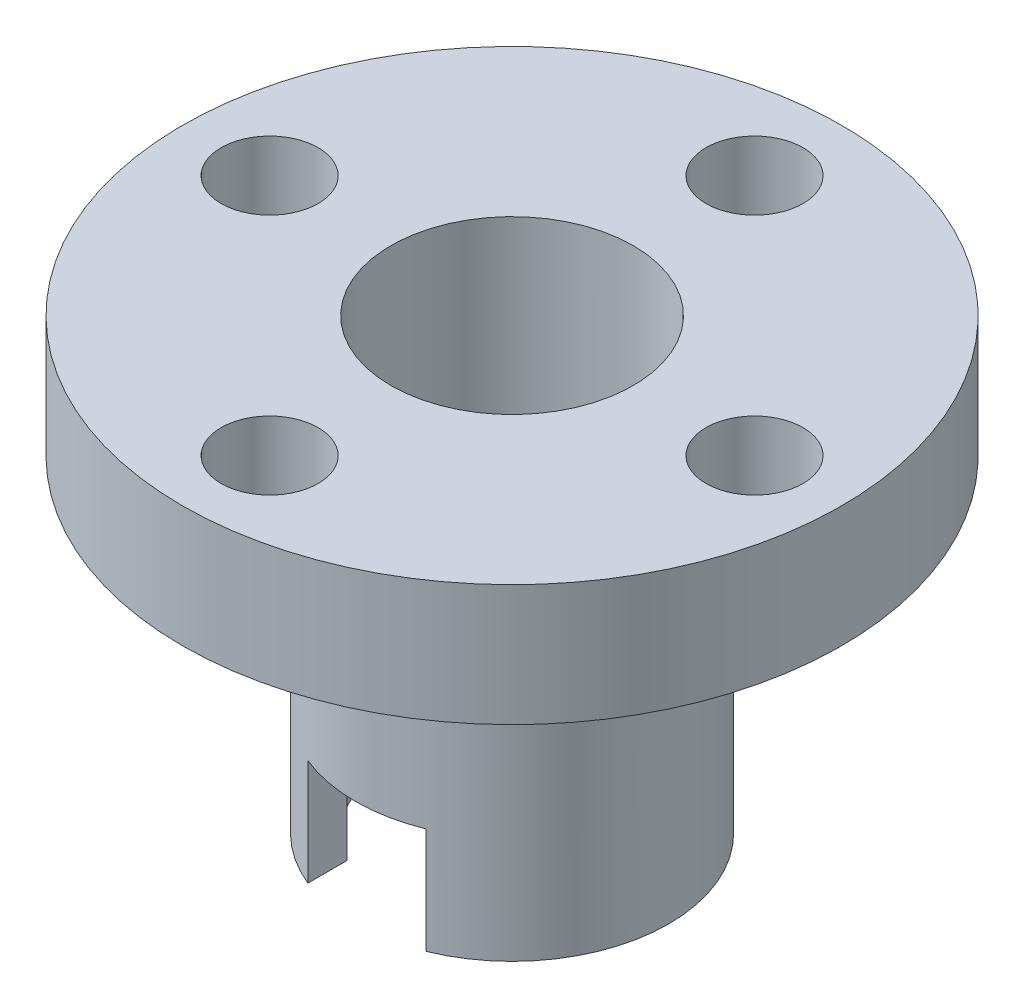
ISO-10303-21;
HEADER;
FILE_DESCRIPTION(('STEP AP214'),'2;1');
FILE_NAME('part.step','',(''),(''),'','','');
FILE_SCHEMA(('AUTOMOTIVE_DESIGN { 1 0 10303 214 1 1 1 1 }'));
ENDSEC;
DATA;
#1=APPLICATION_CONTEXT('core data for automotive mechanical design processes');
#2=APPLICATION_PROTOCOL_DEFINITION('international standard','automotive_design',2000,#1);
#3=PRODUCT_CONTEXT('',#1,'mechanical');
#4=PRODUCT('Part','Part','',(#3));
#5=PRODUCT_RELATED_PRODUCT_CATEGORY('part','',(#4));
#6=PRODUCT_DEFINITION_FORMATION('','',#4);
#7=PRODUCT_DEFINITION_CONTEXT('part definition',#1,'design');
#8=PRODUCT_DEFINITION('design','',#6,#7);
#9=PRODUCT_DEFINITION_SHAPE('','',#8);
#10=(LENGTH_UNIT() NAMED_UNIT(*) SI_UNIT(.MILLI.,.METRE.));
#11=(NAMED_UNIT(*) PLANE_ANGLE_UNIT() SI_UNIT($,.RADIAN.));
#12=(NAMED_UNIT(*) SI_UNIT($,.STERADIAN.) SOLID_ANGLE_UNIT());
#13=UNCERTAINTY_MEASURE_WITH_UNIT(LENGTH_MEASURE(1.E-05),#10,'distance_accuracy_value','');
#14=(GEOMETRIC_REPRESENTATION_CONTEXT(3) GLOBAL_UNCERTAINTY_ASSIGNED_CONTEXT((#13)) GLOBAL_UNIT_ASSIGNED_CONTEXT((#10,
#11,#12)) REPRESENTATION_CONTEXT('',''));
#15=CARTESIAN_POINT('',(0.,0.,0.));
#16=DIRECTION('',(0.,0.,1.));
#17=DIRECTION('',(1.,0.,0.));
#18=AXIS2_PLACEMENT_3D('',#15,#16,#17);
#19=CARTESIAN_POINT('',(0.,0.,0.));
#20=DIRECTION('',(0.,1.,0.));
#21=DIRECTION('',(0.,0.,1.));
#22=AXIS2_PLACEMENT_3D('',#19,#20,#21);
#23=PLANE('',#22);
#24=CARTESIAN_POINT('',(0.,0.,-8.));
#25=DIRECTION('',(0.,1.,0.));
#26=DIRECTION('',(0.,0.,1.));
#27=AXIS2_PLACEMENT_3D('',#24,#25,#26);
#28=CIRCLE('',#27,1.6);
#29=CARTESIAN_POINT('',(0.,0.,-6.4));
#30=VERTEX_POINT('',#29);
#31=EDGE_CURVE('E188',#30,#30,#28,.T.);
#32=ORIENTED_EDGE('',*,*,#31,.T.);
#33=EDGE_LOOP('',(#32));
#34=FACE_BOUND('',#33,.T.);
#35=CARTESIAN_POINT('',(0.,0.,8.));
#36=DIRECTION('',(0.,1.,0.));
#37=DIRECTION('',(0.,0.,1.));
#38=AXIS2_PLACEMENT_3D('',#35,#36,#37);
#39=CIRCLE('',#38,1.6);
#40=CARTESIAN_POINT('',(0.,0.,9.6));
#41=VERTEX_POINT('',#40);
#42=EDGE_CURVE('E192',#41,#41,#39,.T.);
#43=ORIENTED_EDGE('',*,*,#42,.T.);
#44=EDGE_LOOP('',(#43));
#45=FACE_BOUND('',#44,.T.);
#46=CARTESIAN_POINT('',(-8.,0.,0.));
#47=DIRECTION('',(0.,1.,0.));
#48=DIRECTION('',(0.,0.,1.));
#49=AXIS2_PLACEMENT_3D('',#46,#47,#48);
#50=CIRCLE('',#49,1.6);
#51=CARTESIAN_POINT('',(-8.,0.,1.6));
#52=VERTEX_POINT('',#51);
#53=EDGE_CURVE('E196',#52,#52,#50,.T.);
#54=ORIENTED_EDGE('',*,*,#53,.T.);
#55=EDGE_LOOP('',(#54));
#56=FACE_BOUND('',#55,.T.);
#57=CARTESIAN_POINT('',(8.,0.,0.));
#58=DIRECTION('',(0.,1.,0.));
#59=DIRECTION('',(0.,0.,1.));
#60=AXIS2_PLACEMENT_3D('',#57,#58,#59);
#61=CIRCLE('',#60,1.6);
#62=CARTESIAN_POINT('',(8.,0.,1.6));
#63=VERTEX_POINT('',#62);
#64=EDGE_CURVE('E199',#63,#63,#61,.T.);
#65=ORIENTED_EDGE('',*,*,#64,.T.);
#66=EDGE_LOOP('',(#65));
#67=FACE_BOUND('',#66,.T.);
#68=CARTESIAN_POINT('',(0.,0.,0.));
#69=DIRECTION('',(0.,-1.,0.));
#70=DIRECTION('',(0.,0.,-1.));
#71=AXIS2_PLACEMENT_3D('',#68,#69,#70);
#72=CIRCLE('',#71,5.17);
#73=CARTESIAN_POINT('',(0.,0.,-5.17));
#74=VERTEX_POINT('',#73);
#75=EDGE_CURVE('E184',#74,#74,#72,.T.);
#76=ORIENTED_EDGE('',*,*,#75,.F.);
#77=EDGE_LOOP('',(#76));
#78=FACE_BOUND('',#77,.T.);
#79=CARTESIAN_POINT('',(0.,0.,0.));
#80=DIRECTION('',(0.,1.,0.));
#81=DIRECTION('',(0.,0.,1.));
#82=AXIS2_PLACEMENT_3D('',#79,#80,#81);
#83=CIRCLE('',#82,10.875);
#84=CARTESIAN_POINT('',(0.,0.,10.875));
#85=VERTEX_POINT('',#84);
#86=EDGE_CURVE('E19',#85,#85,#83,.T.);
#87=ORIENTED_EDGE('',*,*,#86,.F.);
#88=EDGE_LOOP('',(#87));
#89=FACE_BOUND('',#88,.T.);
#90=ADVANCED_FACE('F16',(#34,#45,#56,#67,#78,#89),#23,.F.);
#91=CARTESIAN_POINT('',(0.,0.,0.));
#92=DIRECTION('',(0.,1.,0.));
#93=DIRECTION('',(0.,0.,1.));
#94=AXIS2_PLACEMENT_3D('',#91,#92,#93);
#95=CYLINDRICAL_SURFACE('',#94,10.875);
#96=ORIENTED_EDGE('',*,*,#86,.T.);
#97=EDGE_LOOP('',(#96));
#98=FACE_BOUND('',#97,.T.);
#99=CARTESIAN_POINT('',(0.,4.,0.));
#100=DIRECTION('',(0.,1.,0.));
#101=DIRECTION('',(0.,0.,1.));
#102=AXIS2_PLACEMENT_3D('',#99,#100,#101);
#103=CIRCLE('',#102,10.875);
#104=CARTESIAN_POINT('',(0.,4.,10.875));
#105=VERTEX_POINT('',#104);
#106=EDGE_CURVE('E180',#105,#105,#103,.T.);
#107=ORIENTED_EDGE('',*,*,#106,.F.);
#108=EDGE_LOOP('',(#107));
#109=FACE_BOUND('',#108,.T.);
#110=ADVANCED_FACE('F208',(#98,#109),#95,.T.);
#111=CARTESIAN_POINT('',(8.,-27.0181398539629,0.));
#112=DIRECTION('',(0.,1.,0.));
#113=DIRECTION('',(0.,0.,1.));
#114=AXIS2_PLACEMENT_3D('',#111,#112,#113);
#115=CYLINDRICAL_SURFACE('',#114,1.6);
#116=CARTESIAN_POINT('',(8.,4.,0.));
#117=DIRECTION('',(0.,1.,0.));
#118=DIRECTION('',(0.,0.,1.));
#119=AXIS2_PLACEMENT_3D('',#116,#117,#118);
#120=CIRCLE('',#119,1.6);
#121=CARTESIAN_POINT('',(8.,4.,1.6));
#122=VERTEX_POINT('',#121);
#123=EDGE_CURVE('E176',#122,#122,#120,.F.);
#124=ORIENTED_EDGE('',*,*,#123,.F.);
#125=EDGE_LOOP('',(#124));
#126=FACE_BOUND('',#125,.T.);
#127=ORIENTED_EDGE('',*,*,#64,.F.);
#128=EDGE_LOOP('',(#127));
#129=FACE_BOUND('',#128,.T.);
#130=ADVANCED_FACE('F216',(#126,#129),#115,.F.);
#131=CARTESIAN_POINT('',(-8.,-27.0181398539629,0.));
#132=DIRECTION('',(0.,1.,0.));
#133=DIRECTION('',(0.,0.,1.));
#134=AXIS2_PLACEMENT_3D('',#131,#132,#133);
#135=CYLINDRICAL_SURFACE('',#134,1.6);
#136=CARTESIAN_POINT('',(-8.,4.,0.));
#137=DIRECTION('',(0.,1.,0.));
#138=DIRECTION('',(0.,0.,1.));
#139=AXIS2_PLACEMENT_3D('',#136,#137,#138);
#140=CIRCLE('',#139,1.6);
#141=CARTESIAN_POINT('',(-8.,4.,1.6));
#142=VERTEX_POINT('',#141);
#143=EDGE_CURVE('E172',#142,#142,#140,.F.);
#144=ORIENTED_EDGE('',*,*,#143,.F.);
#145=EDGE_LOOP('',(#144));
#146=FACE_BOUND('',#145,.T.);
#147=ORIENTED_EDGE('',*,*,#53,.F.);
#148=EDGE_LOOP('',(#147));
#149=FACE_BOUND('',#148,.T.);
#150=ADVANCED_FACE('F270',(#146,#149),#135,.F.);
#151=CARTESIAN_POINT('',(0.,-27.0181398539629,8.));
#152=DIRECTION('',(0.,1.,0.));
#153=DIRECTION('',(0.,0.,1.));
#154=AXIS2_PLACEMENT_3D('',#151,#152,#153);
#155=CYLINDRICAL_SURFACE('',#154,1.6);
#156=CARTESIAN_POINT('',(0.,4.,8.));
#157=DIRECTION('',(0.,1.,0.));
#158=DIRECTION('',(0.,0.,1.));
#159=AXIS2_PLACEMENT_3D('',#156,#157,#158);
#160=CIRCLE('',#159,1.6);
#161=CARTESIAN_POINT('',(0.,4.,9.6));
#162=VERTEX_POINT('',#161);
#163=EDGE_CURVE('E168',#162,#162,#160,.F.);
#164=ORIENTED_EDGE('',*,*,#163,.F.);
#165=EDGE_LOOP('',(#164));
#166=FACE_BOUND('',#165,.T.);
#167=ORIENTED_EDGE('',*,*,#42,.F.);
#168=EDGE_LOOP('',(#167));
#169=FACE_BOUND('',#168,.T.);
#170=ADVANCED_FACE('F266',(#166,#169),#155,.F.);
#171=CARTESIAN_POINT('',(0.,-27.0181398539629,-8.));
#172=DIRECTION('',(0.,1.,0.));
#173=DIRECTION('',(0.,0.,1.));
#174=AXIS2_PLACEMENT_3D('',#171,#172,#173);
#175=CYLINDRICAL_SURFACE('',#174,1.6);
#176=CARTESIAN_POINT('',(0.,4.,-8.));
#177=DIRECTION('',(0.,1.,0.));
#178=DIRECTION('',(0.,0.,1.));
#179=AXIS2_PLACEMENT_3D('',#176,#177,#178);
#180=CIRCLE('',#179,1.6);
#181=CARTESIAN_POINT('',(0.,4.,-6.4));
#182=VERTEX_POINT('',#181);
#183=EDGE_CURVE('E106',#182,#182,#180,.F.);
#184=ORIENTED_EDGE('',*,*,#183,.F.);
#185=EDGE_LOOP('',(#184));
#186=FACE_BOUND('',#185,.T.);
#187=ORIENTED_EDGE('',*,*,#31,.F.);
#188=EDGE_LOOP('',(#187));
#189=FACE_BOUND('',#188,.T.);
#190=ADVANCED_FACE('F262',(#186,#189),#175,.F.);
#191=CARTESIAN_POINT('',(0.,0.,0.));
#192=DIRECTION('',(0.,-1.,0.));
#193=DIRECTION('',(0.,0.,-1.));
#194=AXIS2_PLACEMENT_3D('',#191,#192,#193);
#195=CYLINDRICAL_SURFACE('',#194,5.17);
#196=ORIENTED_EDGE('',*,*,#75,.T.);
#197=EDGE_LOOP('',(#196));
#198=FACE_BOUND('',#197,.T.);
#199=DIRECTION('',(0.,1.,0.));
#200=VECTOR('',#199,1.);
#201=CARTESIAN_POINT('',(1.95,-9.05,-4.78815204436952));
#202=LINE('',#201,#200);
#203=CARTESIAN_POINT('',(1.95,-10.8,-4.78815204436952));
#204=VERTEX_POINT('',#203);
#205=CARTESIAN_POINT('',(1.95,-7.3,-4.78815204436952));
#206=VERTEX_POINT('',#205);
#207=EDGE_CURVE('E124',#204,#206,#202,.T.);
#208=ORIENTED_EDGE('',*,*,#207,.T.);
#209=CARTESIAN_POINT('',(0.,-7.3,0.));
#210=DIRECTION('',(0.,-1.,0.));
#211=DIRECTION('',(0.,0.,-1.));
#212=AXIS2_PLACEMENT_3D('',#209,#210,#211);
#213=CIRCLE('',#212,5.17);
#214=CARTESIAN_POINT('',(-1.95,-7.3,-4.78815204436952));
#215=VERTEX_POINT('',#214);
#216=EDGE_CURVE('E115',#206,#215,#213,.F.);
#217=ORIENTED_EDGE('',*,*,#216,.T.);
#218=DIRECTION('',(0.,1.,0.));
#219=VECTOR('',#218,1.);
#220=CARTESIAN_POINT('',(-1.95,-9.05,-4.78815204436952));
#221=LINE('',#220,#219);
#222=CARTESIAN_POINT('',(-1.95,-10.8,-4.78815204436952));
#223=VERTEX_POINT('',#222);
#224=EDGE_CURVE('E109',#215,#223,#221,.F.);
#225=ORIENTED_EDGE('',*,*,#224,.T.);
#226=CARTESIAN_POINT('',(0.,-10.8,0.));
#227=DIRECTION('',(0.,-1.,0.));
#228=DIRECTION('',(0.,0.,-1.));
#229=AXIS2_PLACEMENT_3D('',#226,#227,#228);
#230=CIRCLE('',#229,5.17);
#231=CARTESIAN_POINT('',(-1.95,-10.8,4.78815204436952));
#232=VERTEX_POINT('',#231);
#233=EDGE_CURVE('E96',#223,#232,#230,.F.);
#234=ORIENTED_EDGE('',*,*,#233,.T.);
#235=DIRECTION('',(0.,1.,0.));
#236=VECTOR('',#235,1.);
#237=CARTESIAN_POINT('',(-1.95,-9.05,4.78815204436952));
#238=LINE('',#237,#236);
#239=CARTESIAN_POINT('',(-1.95,-7.3,4.78815204436952));
#240=VERTEX_POINT('',#239);
#241=EDGE_CURVE('E134',#232,#240,#238,.T.);
#242=ORIENTED_EDGE('',*,*,#241,.T.);
#243=CARTESIAN_POINT('',(0.,-7.3,0.));
#244=DIRECTION('',(0.,-1.,0.));
#245=DIRECTION('',(0.,0.,-1.));
#246=AXIS2_PLACEMENT_3D('',#243,#244,#245);
#247=CIRCLE('',#246,5.17);
#248=CARTESIAN_POINT('',(1.95,-7.3,4.78815204436952));
#249=VERTEX_POINT('',#248);
#250=EDGE_CURVE('E162',#240,#249,#247,.F.);
#251=ORIENTED_EDGE('',*,*,#250,.T.);
#252=DIRECTION('',(0.,1.,0.));
#253=VECTOR('',#252,1.);
#254=CARTESIAN_POINT('',(1.95,-9.05,4.78815204436952));
#255=LINE('',#254,#253);
#256=CARTESIAN_POINT('',(1.95,-10.8,4.78815204436952));
#257=VERTEX_POINT('',#256);
#258=EDGE_CURVE('E129',#249,#257,#255,.F.);
#259=ORIENTED_EDGE('',*,*,#258,.T.);
#260=CARTESIAN_POINT('',(0.,-10.8,0.));
#261=DIRECTION('',(0.,-1.,0.));
#262=DIRECTION('',(0.,0.,-1.));
#263=AXIS2_PLACEMENT_3D('',#260,#261,#262);
#264=CIRCLE('',#263,5.17);
#265=EDGE_CURVE('E159',#257,#204,#264,.F.);
#266=ORIENTED_EDGE('',*,*,#265,.T.);
#267=EDGE_LOOP('',(#208,#217,#225,#234,#242,#251,#259,#266));
#268=FACE_BOUND('',#267,.T.);
#269=ADVANCED_FACE('F113',(#198,#268),#195,.T.);
#270=CARTESIAN_POINT('',(0.,4.,0.));
#271=DIRECTION('',(0.,1.,0.));
#272=DIRECTION('',(0.,0.,1.));
#273=AXIS2_PLACEMENT_3D('',#270,#271,#272);
#274=PLANE('',#273);
#275=CARTESIAN_POINT('',(0.,4.,0.));
#276=DIRECTION('',(0.,1.,0.));
#277=DIRECTION('',(0.,0.,1.));
#278=AXIS2_PLACEMENT_3D('',#275,#276,#277);
#279=CIRCLE('',#278,4.);
#280=CARTESIAN_POINT('',(0.,4.,4.));
#281=VERTEX_POINT('',#280);
#282=EDGE_CURVE('E111',#281,#281,#279,.F.);
#283=ORIENTED_EDGE('',*,*,#282,.T.);
#284=EDGE_LOOP('',(#283));
#285=FACE_BOUND('',#284,.T.);
#286=ORIENTED_EDGE('',*,*,#183,.T.);
#287=EDGE_LOOP('',(#286));
#288=FACE_BOUND('',#287,.T.);
#289=ORIENTED_EDGE('',*,*,#163,.T.);
#290=EDGE_LOOP('',(#289));
#291=FACE_BOUND('',#290,.T.);
#292=ORIENTED_EDGE('',*,*,#143,.T.);
#293=EDGE_LOOP('',(#292));
#294=FACE_BOUND('',#293,.T.);
#295=ORIENTED_EDGE('',*,*,#123,.T.);
#296=EDGE_LOOP('',(#295));
#297=FACE_BOUND('',#296,.T.);
#298=ORIENTED_EDGE('',*,*,#106,.T.);
#299=EDGE_LOOP('',(#298));
#300=FACE_BOUND('',#299,.T.);
#301=ADVANCED_FACE('F256',(#285,#288,#291,#294,#297,#300),#274,.T.);
#302=CARTESIAN_POINT('',(0.,-10.8,0.));
#303=DIRECTION('',(0.,1.,0.));
#304=DIRECTION('',(0.,0.,1.));
#305=AXIS2_PLACEMENT_3D('',#302,#303,#304);
#306=PLANE('',#305);
#307=CARTESIAN_POINT('',(0.,-10.8,0.));
#308=DIRECTION('',(0.,1.,0.));
#309=DIRECTION('',(0.,0.,1.));
#310=AXIS2_PLACEMENT_3D('',#307,#308,#309);
#311=CIRCLE('',#310,4.);
#312=CARTESIAN_POINT('',(-1.95,-10.8,-3.49249194702006));
#313=VERTEX_POINT('',#312);
#314=CARTESIAN_POINT('',(-1.95,-10.8,3.49249194702006));
#315=VERTEX_POINT('',#314);
#316=EDGE_CURVE('E152',#313,#315,#311,.T.);
#317=ORIENTED_EDGE('',*,*,#316,.T.);
#318=DIRECTION('',(0.,0.,1.));
#319=VECTOR('',#318,1.);
#320=CARTESIAN_POINT('',(-1.95,-10.8,0.));
#321=LINE('',#320,#319);
#322=EDGE_CURVE('E101',#315,#232,#321,.T.);
#323=ORIENTED_EDGE('',*,*,#322,.T.);
#324=ORIENTED_EDGE('',*,*,#233,.F.);
#325=DIRECTION('',(0.,0.,1.));
#326=VECTOR('',#325,1.);
#327=CARTESIAN_POINT('',(-1.95,-10.8,0.));
#328=LINE('',#327,#326);
#329=EDGE_CURVE('E100',#223,#313,#328,.T.);
#330=ORIENTED_EDGE('',*,*,#329,.T.);
#331=EDGE_LOOP('',(#317,#323,#324,#330));
#332=FACE_BOUND('',#331,.T.);
#333=ADVANCED_FACE('F99',(#332),#306,.F.);
#334=CARTESIAN_POINT('',(-1.95,-9.05,0.));
#335=DIRECTION('',(-1.,0.,0.));
#336=DIRECTION('',(0.,0.,1.));
#337=AXIS2_PLACEMENT_3D('',#334,#335,#336);
#338=PLANE('',#337);
#339=DIRECTION('',(0.,0.,1.));
#340=VECTOR('',#339,1.);
#341=CARTESIAN_POINT('',(-1.95,-7.3,-5.17));
#342=LINE('',#341,#340);
#343=CARTESIAN_POINT('',(-1.95,-7.3,3.49249194702006));
#344=VERTEX_POINT('',#343);
#345=EDGE_CURVE('E137',#344,#240,#342,.T.);
#346=ORIENTED_EDGE('',*,*,#345,.T.);
#347=ORIENTED_EDGE('',*,*,#241,.F.);
#348=ORIENTED_EDGE('',*,*,#322,.F.);
#349=DIRECTION('',(0.,1.,0.));
#350=VECTOR('',#349,1.);
#351=CARTESIAN_POINT('',(-1.95,0.,3.49249194702006));
#352=LINE('',#351,#350);
#353=EDGE_CURVE('E151',#315,#344,#352,.T.);
#354=ORIENTED_EDGE('',*,*,#353,.T.);
#355=EDGE_LOOP('',(#346,#347,#348,#354));
#356=FACE_BOUND('',#355,.T.);
#357=ADVANCED_FACE('F249',(#356),#338,.F.);
#358=CARTESIAN_POINT('',(0.,-7.3,-5.17));
#359=DIRECTION('',(0.,1.,0.));
#360=DIRECTION('',(0.,0.,1.));
#361=AXIS2_PLACEMENT_3D('',#358,#359,#360);
#362=PLANE('',#361);
#363=DIRECTION('',(0.,0.,-1.));
#364=VECTOR('',#363,1.);
#365=CARTESIAN_POINT('',(1.95,-7.3,0.));
#366=LINE('',#365,#364);
#367=CARTESIAN_POINT('',(1.95,-7.3,3.49249194702006));
#368=VERTEX_POINT('',#367);
#369=EDGE_CURVE('E133',#368,#249,#366,.F.);
#370=ORIENTED_EDGE('',*,*,#369,.T.);
#371=ORIENTED_EDGE('',*,*,#250,.F.);
#372=ORIENTED_EDGE('',*,*,#345,.F.);
#373=CARTESIAN_POINT('',(0.,-7.3,0.));
#374=DIRECTION('',(0.,1.,0.));
#375=DIRECTION('',(0.,0.,1.));
#376=AXIS2_PLACEMENT_3D('',#373,#374,#375);
#377=CIRCLE('',#376,4.);
#378=EDGE_CURVE('E147',#344,#368,#377,.T.);
#379=ORIENTED_EDGE('',*,*,#378,.T.);
#380=EDGE_LOOP('',(#370,#371,#372,#379));
#381=FACE_BOUND('',#380,.T.);
#382=ADVANCED_FACE('F245',(#381),#362,.F.);
#383=CARTESIAN_POINT('',(1.95,-9.05,0.));
#384=DIRECTION('',(1.,0.,0.));
#385=DIRECTION('',(0.,0.,-1.));
#386=AXIS2_PLACEMENT_3D('',#383,#384,#385);
#387=PLANE('',#386);
#388=DIRECTION('',(0.,0.,1.));
#389=VECTOR('',#388,1.);
#390=CARTESIAN_POINT('',(1.95,-10.8,0.));
#391=LINE('',#390,#389);
#392=CARTESIAN_POINT('',(1.95,-10.8,3.49249194702006));
#393=VERTEX_POINT('',#392);
#394=EDGE_CURVE('E132',#393,#257,#391,.T.);
#395=ORIENTED_EDGE('',*,*,#394,.T.);
#396=ORIENTED_EDGE('',*,*,#258,.F.);
#397=ORIENTED_EDGE('',*,*,#369,.F.);
#398=DIRECTION('',(0.,1.,0.));
#399=VECTOR('',#398,1.);
#400=CARTESIAN_POINT('',(1.95,0.,3.49249194702006));
#401=LINE('',#400,#399);
#402=EDGE_CURVE('E146',#368,#393,#401,.F.);
#403=ORIENTED_EDGE('',*,*,#402,.T.);
#404=EDGE_LOOP('',(#395,#396,#397,#403));
#405=FACE_BOUND('',#404,.T.);
#406=ADVANCED_FACE('F241',(#405),#387,.F.);
#407=CARTESIAN_POINT('',(0.,-10.8,0.));
#408=DIRECTION('',(0.,1.,0.));
#409=DIRECTION('',(0.,0.,1.));
#410=AXIS2_PLACEMENT_3D('',#407,#408,#409);
#411=PLANE('',#410);
#412=ORIENTED_EDGE('',*,*,#265,.F.);
#413=ORIENTED_EDGE('',*,*,#394,.F.);
#414=CARTESIAN_POINT('',(0.,-10.8,0.));
#415=DIRECTION('',(0.,1.,0.));
#416=DIRECTION('',(0.,0.,1.));
#417=AXIS2_PLACEMENT_3D('',#414,#415,#416);
#418=CIRCLE('',#417,4.);
#419=CARTESIAN_POINT('',(1.95,-10.8,-3.49249194702006));
#420=VERTEX_POINT('',#419);
#421=EDGE_CURVE('E142',#393,#420,#418,.T.);
#422=ORIENTED_EDGE('',*,*,#421,.T.);
#423=DIRECTION('',(0.,0.,-1.));
#424=VECTOR('',#423,1.);
#425=CARTESIAN_POINT('',(1.95,-10.8,0.));
#426=LINE('',#425,#424);
#427=EDGE_CURVE('E128',#420,#204,#426,.T.);
#428=ORIENTED_EDGE('',*,*,#427,.T.);
#429=EDGE_LOOP('',(#412,#413,#422,#428));
#430=FACE_BOUND('',#429,.T.);
#431=ADVANCED_FACE('F237',(#430),#411,.F.);
#432=CARTESIAN_POINT('',(1.95,-9.05,0.));
#433=DIRECTION('',(1.,0.,0.));
#434=DIRECTION('',(0.,0.,-1.));
#435=AXIS2_PLACEMENT_3D('',#432,#433,#434);
#436=PLANE('',#435);
#437=DIRECTION('',(0.,0.,1.));
#438=VECTOR('',#437,1.);
#439=CARTESIAN_POINT('',(1.95,-7.3,-5.17));
#440=LINE('',#439,#438);
#441=CARTESIAN_POINT('',(1.95,-7.3,-3.49249194702006));
#442=VERTEX_POINT('',#441);
#443=EDGE_CURVE('E127',#442,#206,#440,.F.);
#444=ORIENTED_EDGE('',*,*,#443,.T.);
#445=ORIENTED_EDGE('',*,*,#207,.F.);
#446=ORIENTED_EDGE('',*,*,#427,.F.);
#447=DIRECTION('',(0.,1.,0.));
#448=VECTOR('',#447,1.);
#449=CARTESIAN_POINT('',(1.95,0.,-3.49249194702006));
#450=LINE('',#449,#448);
#451=EDGE_CURVE('E141',#420,#442,#450,.T.);
#452=ORIENTED_EDGE('',*,*,#451,.T.);
#453=EDGE_LOOP('',(#444,#445,#446,#452));
#454=FACE_BOUND('',#453,.T.);
#455=ADVANCED_FACE('F233',(#454),#436,.F.);
#456=CARTESIAN_POINT('',(0.,-7.3,-5.17));
#457=DIRECTION('',(0.,1.,0.));
#458=DIRECTION('',(0.,0.,1.));
#459=AXIS2_PLACEMENT_3D('',#456,#457,#458);
#460=PLANE('',#459);
#461=DIRECTION('',(0.,0.,1.));
#462=VECTOR('',#461,1.);
#463=CARTESIAN_POINT('',(-1.95,-7.3,0.));
#464=LINE('',#463,#462);
#465=CARTESIAN_POINT('',(-1.95,-7.3,-3.49249194702006));
#466=VERTEX_POINT('',#465);
#467=EDGE_CURVE('E38',#466,#215,#464,.F.);
#468=ORIENTED_EDGE('',*,*,#467,.T.);
#469=ORIENTED_EDGE('',*,*,#216,.F.);
#470=ORIENTED_EDGE('',*,*,#443,.F.);
#471=CARTESIAN_POINT('',(0.,-7.3,0.));
#472=DIRECTION('',(0.,1.,0.));
#473=DIRECTION('',(0.,0.,1.));
#474=AXIS2_PLACEMENT_3D('',#471,#472,#473);
#475=CIRCLE('',#474,4.);
#476=EDGE_CURVE('E26',#442,#466,#475,.T.);
#477=ORIENTED_EDGE('',*,*,#476,.T.);
#478=EDGE_LOOP('',(#468,#469,#470,#477));
#479=FACE_BOUND('',#478,.T.);
#480=ADVANCED_FACE('F226',(#479),#460,.F.);
#481=CARTESIAN_POINT('',(-1.95,-9.05,0.));
#482=DIRECTION('',(-1.,0.,0.));
#483=DIRECTION('',(0.,0.,1.));
#484=AXIS2_PLACEMENT_3D('',#481,#482,#483);
#485=PLANE('',#484);
#486=ORIENTED_EDGE('',*,*,#329,.F.);
#487=ORIENTED_EDGE('',*,*,#224,.F.);
#488=ORIENTED_EDGE('',*,*,#467,.F.);
#489=DIRECTION('',(0.,1.,0.));
#490=VECTOR('',#489,1.);
#491=CARTESIAN_POINT('',(-1.95,0.,-3.49249194702006));
#492=LINE('',#491,#490);
#493=EDGE_CURVE('E11',#466,#313,#492,.F.);
#494=ORIENTED_EDGE('',*,*,#493,.T.);
#495=EDGE_LOOP('',(#486,#487,#488,#494));
#496=FACE_BOUND('',#495,.T.);
#497=ADVANCED_FACE('F108',(#496),#485,.F.);
#498=CARTESIAN_POINT('',(0.,0.,0.));
#499=DIRECTION('',(0.,1.,0.));
#500=DIRECTION('',(0.,0.,1.));
#501=AXIS2_PLACEMENT_3D('',#498,#499,#500);
#502=CYLINDRICAL_SURFACE('',#501,4.);
#503=ORIENTED_EDGE('',*,*,#476,.F.);
#504=ORIENTED_EDGE('',*,*,#451,.F.);
#505=ORIENTED_EDGE('',*,*,#421,.F.);
#506=ORIENTED_EDGE('',*,*,#402,.F.);
#507=ORIENTED_EDGE('',*,*,#378,.F.);
#508=ORIENTED_EDGE('',*,*,#353,.F.);
#509=ORIENTED_EDGE('',*,*,#316,.F.);
#510=ORIENTED_EDGE('',*,*,#493,.F.);
#511=EDGE_LOOP('',(#503,#504,#505,#506,#507,#508,#509,#510));
#512=FACE_BOUND('',#511,.T.);
#513=ORIENTED_EDGE('',*,*,#282,.F.);
#514=EDGE_LOOP('',(#513));
#515=FACE_BOUND('',#514,.T.);
#516=ADVANCED_FACE('F218',(#512,#515),#502,.F.);
#517=CLOSED_SHELL('',(#90,#110,#130,#150,#170,#190,#269,#301,#333,#357,#382,#406,#431,#455,#480,
#497,#516));
#518=MANIFOLD_SOLID_BREP('B1',#517);
#519=ADVANCED_BREP_SHAPE_REPRESENTATION('',(#18,#518),#14);
#520=SHAPE_DEFINITION_REPRESENTATION(#9,#519);
ENDSEC;
END-ISO-10303-21;
